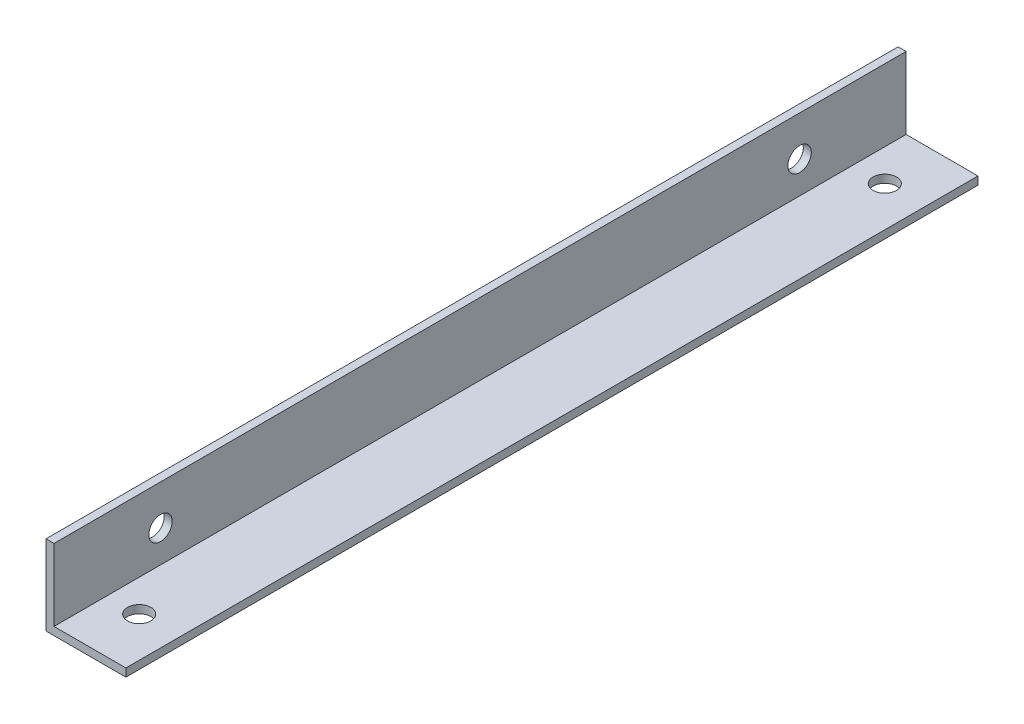
ISO-10303-21;
HEADER;
FILE_DESCRIPTION(('STEP AP214'),'2;1');
FILE_NAME('part.step','',(''),(''),'','','');
FILE_SCHEMA(('AUTOMOTIVE_DESIGN { 1 0 10303 214 1 1 1 1 }'));
ENDSEC;
DATA;
#1=APPLICATION_CONTEXT('core data for automotive mechanical design processes');
#2=APPLICATION_PROTOCOL_DEFINITION('international standard','automotive_design',2000,#1);
#3=PRODUCT_CONTEXT('',#1,'mechanical');
#4=PRODUCT('Part','Part','',(#3));
#5=PRODUCT_RELATED_PRODUCT_CATEGORY('part','',(#4));
#6=PRODUCT_DEFINITION_FORMATION('','',#4);
#7=PRODUCT_DEFINITION_CONTEXT('part definition',#1,'design');
#8=PRODUCT_DEFINITION('design','',#6,#7);
#9=PRODUCT_DEFINITION_SHAPE('','',#8);
#10=(LENGTH_UNIT() NAMED_UNIT(*) SI_UNIT(.MILLI.,.METRE.));
#11=(NAMED_UNIT(*) PLANE_ANGLE_UNIT() SI_UNIT($,.RADIAN.));
#12=(NAMED_UNIT(*) SI_UNIT($,.STERADIAN.) SOLID_ANGLE_UNIT());
#13=UNCERTAINTY_MEASURE_WITH_UNIT(LENGTH_MEASURE(1.E-05),#10,'distance_accuracy_value','');
#14=(GEOMETRIC_REPRESENTATION_CONTEXT(3) GLOBAL_UNCERTAINTY_ASSIGNED_CONTEXT((#13)) GLOBAL_UNIT_ASSIGNED_CONTEXT((#10,
#11,#12)) REPRESENTATION_CONTEXT('',''));
#15=CARTESIAN_POINT('',(0.,0.,0.));
#16=DIRECTION('',(0.,0.,1.));
#17=DIRECTION('',(1.,0.,0.));
#18=AXIS2_PLACEMENT_3D('',#15,#16,#17);
#19=CARTESIAN_POINT('',(15.,0.,160.));
#20=DIRECTION('',(0.,1.,0.));
#21=DIRECTION('',(-1.,0.,0.));
#22=AXIS2_PLACEMENT_3D('',#19,#20,#21);
#23=PLANE('',#22);
#24=CARTESIAN_POINT('',(7.5,0.,10.));
#25=DIRECTION('',(0.,-1.,0.));
#26=DIRECTION('',(1.,0.,0.));
#27=AXIS2_PLACEMENT_3D('',#24,#25,#26);
#28=CIRCLE('',#27,2.2);
#29=CARTESIAN_POINT('',(9.7,0.,10.));
#30=VERTEX_POINT('',#29);
#31=EDGE_CURVE('E137',#30,#30,#28,.T.);
#32=ORIENTED_EDGE('',*,*,#31,.F.);
#33=EDGE_LOOP('',(#32));
#34=FACE_BOUND('',#33,.T.);
#35=CARTESIAN_POINT('',(7.49999999999998,0.,150.));
#36=DIRECTION('',(0.,-1.,0.));
#37=DIRECTION('',(1.,0.,0.));
#38=AXIS2_PLACEMENT_3D('',#35,#36,#37);
#39=CIRCLE('',#38,2.2);
#40=CARTESIAN_POINT('',(9.69999999999998,0.,150.));
#41=VERTEX_POINT('',#40);
#42=EDGE_CURVE('E143',#41,#41,#39,.T.);
#43=ORIENTED_EDGE('',*,*,#42,.F.);
#44=EDGE_LOOP('',(#43));
#45=FACE_BOUND('',#44,.T.);
#46=DIRECTION('',(1.,0.,0.));
#47=VECTOR('',#46,1.);
#48=CARTESIAN_POINT('',(15.,0.,0.));
#49=LINE('',#48,#47);
#50=CARTESIAN_POINT('',(0.,0.,0.));
#51=VERTEX_POINT('',#50);
#52=CARTESIAN_POINT('',(15.,0.,0.));
#53=VERTEX_POINT('',#52);
#54=EDGE_CURVE('E119',#51,#53,#49,.T.);
#55=ORIENTED_EDGE('',*,*,#54,.T.);
#56=DIRECTION('',(0.,0.,-1.));
#57=VECTOR('',#56,1.);
#58=CARTESIAN_POINT('',(15.,0.,160.));
#59=LINE('',#58,#57);
#60=CARTESIAN_POINT('',(15.,0.,160.));
#61=VERTEX_POINT('',#60);
#62=EDGE_CURVE('E11',#61,#53,#59,.T.);
#63=ORIENTED_EDGE('',*,*,#62,.F.);
#64=DIRECTION('',(1.,0.,0.));
#65=VECTOR('',#64,1.);
#66=CARTESIAN_POINT('',(15.,0.,160.));
#67=LINE('',#66,#65);
#68=CARTESIAN_POINT('',(0.,0.,160.));
#69=VERTEX_POINT('',#68);
#70=EDGE_CURVE('E130',#69,#61,#67,.T.);
#71=ORIENTED_EDGE('',*,*,#70,.F.);
#72=DIRECTION('',(0.,0.,-1.));
#73=VECTOR('',#72,1.);
#74=CARTESIAN_POINT('',(0.,0.,160.));
#75=LINE('',#74,#73);
#76=EDGE_CURVE('E115',#69,#51,#75,.T.);
#77=ORIENTED_EDGE('',*,*,#76,.T.);
#78=EDGE_LOOP('',(#55,#63,#71,#77));
#79=FACE_BOUND('',#78,.T.);
#80=ADVANCED_FACE('F33',(#34,#45,#79),#23,.F.);
#81=CARTESIAN_POINT('',(15.,1.5,160.));
#82=DIRECTION('',(-1.,0.,0.));
#83=DIRECTION('',(0.,0.,1.));
#84=AXIS2_PLACEMENT_3D('',#81,#82,#83);
#85=PLANE('',#84);
#86=DIRECTION('',(0.,1.,0.));
#87=VECTOR('',#86,1.);
#88=CARTESIAN_POINT('',(15.,1.5,0.));
#89=LINE('',#88,#87);
#90=CARTESIAN_POINT('',(15.,1.5,0.));
#91=VERTEX_POINT('',#90);
#92=EDGE_CURVE('E122',#53,#91,#89,.T.);
#93=ORIENTED_EDGE('',*,*,#92,.T.);
#94=DIRECTION('',(0.,0.,-1.));
#95=VECTOR('',#94,1.);
#96=CARTESIAN_POINT('',(15.,1.5,160.));
#97=LINE('',#96,#95);
#98=CARTESIAN_POINT('',(15.,1.5,160.));
#99=VERTEX_POINT('',#98);
#100=EDGE_CURVE('E42',#99,#91,#97,.T.);
#101=ORIENTED_EDGE('',*,*,#100,.F.);
#102=DIRECTION('',(0.,1.,0.));
#103=VECTOR('',#102,1.);
#104=CARTESIAN_POINT('',(15.,1.5,160.));
#105=LINE('',#104,#103);
#106=EDGE_CURVE('E88',#61,#99,#105,.T.);
#107=ORIENTED_EDGE('',*,*,#106,.F.);
#108=ORIENTED_EDGE('',*,*,#62,.T.);
#109=EDGE_LOOP('',(#93,#101,#107,#108));
#110=FACE_BOUND('',#109,.T.);
#111=ADVANCED_FACE('F163',(#110),#85,.F.);
#112=CARTESIAN_POINT('',(1.5,1.5,160.));
#113=DIRECTION('',(0.,-1.,0.));
#114=DIRECTION('',(0.,0.,-1.));
#115=AXIS2_PLACEMENT_3D('',#112,#113,#114);
#116=PLANE('',#115);
#117=CARTESIAN_POINT('',(7.5,1.5,10.));
#118=DIRECTION('',(0.,-1.,0.));
#119=DIRECTION('',(0.,0.,-1.));
#120=AXIS2_PLACEMENT_3D('',#117,#118,#119);
#121=CIRCLE('',#120,2.2);
#122=CARTESIAN_POINT('',(7.5,1.5,7.8));
#123=VERTEX_POINT('',#122);
#124=EDGE_CURVE('E36',#123,#123,#121,.T.);
#125=ORIENTED_EDGE('',*,*,#124,.T.);
#126=EDGE_LOOP('',(#125));
#127=FACE_BOUND('',#126,.T.);
#128=CARTESIAN_POINT('',(7.49999999999998,1.5,150.));
#129=DIRECTION('',(0.,-1.,0.));
#130=DIRECTION('',(0.,0.,-1.));
#131=AXIS2_PLACEMENT_3D('',#128,#129,#130);
#132=CIRCLE('',#131,2.2);
#133=CARTESIAN_POINT('',(7.49999999999998,1.5,147.8));
#134=VERTEX_POINT('',#133);
#135=EDGE_CURVE('E135',#134,#134,#132,.T.);
#136=ORIENTED_EDGE('',*,*,#135,.T.);
#137=EDGE_LOOP('',(#136));
#138=FACE_BOUND('',#137,.T.);
#139=DIRECTION('',(-1.,0.,0.));
#140=VECTOR('',#139,1.);
#141=CARTESIAN_POINT('',(1.5,1.5,0.));
#142=LINE('',#141,#140);
#143=CARTESIAN_POINT('',(1.5,1.5,0.));
#144=VERTEX_POINT('',#143);
#145=EDGE_CURVE('E125',#91,#144,#142,.T.);
#146=ORIENTED_EDGE('',*,*,#145,.T.);
#147=DIRECTION('',(0.,0.,-1.));
#148=VECTOR('',#147,1.);
#149=CARTESIAN_POINT('',(1.5,1.5,160.));
#150=LINE('',#149,#148);
#151=CARTESIAN_POINT('',(1.5,1.5,160.));
#152=VERTEX_POINT('',#151);
#153=EDGE_CURVE('E110',#152,#144,#150,.T.);
#154=ORIENTED_EDGE('',*,*,#153,.F.);
#155=DIRECTION('',(-1.,0.,0.));
#156=VECTOR('',#155,1.);
#157=CARTESIAN_POINT('',(1.5,1.5,160.));
#158=LINE('',#157,#156);
#159=EDGE_CURVE('E101',#99,#152,#158,.T.);
#160=ORIENTED_EDGE('',*,*,#159,.F.);
#161=ORIENTED_EDGE('',*,*,#100,.T.);
#162=EDGE_LOOP('',(#146,#154,#160,#161));
#163=FACE_BOUND('',#162,.T.);
#164=ADVANCED_FACE('F166',(#127,#138,#163),#116,.F.);
#165=CARTESIAN_POINT('',(1.5,15.,160.));
#166=DIRECTION('',(-1.,0.,0.));
#167=DIRECTION('',(0.,-1.,0.));
#168=AXIS2_PLACEMENT_3D('',#165,#166,#167);
#169=PLANE('',#168);
#170=CARTESIAN_POINT('',(1.5,7.49999999999998,20.));
#171=DIRECTION('',(-1.,0.,0.));
#172=DIRECTION('',(0.,-1.,0.));
#173=AXIS2_PLACEMENT_3D('',#170,#171,#172);
#174=CIRCLE('',#173,2.2);
#175=CARTESIAN_POINT('',(1.5,5.29999999999998,20.));
#176=VERTEX_POINT('',#175);
#177=EDGE_CURVE('E123',#176,#176,#174,.T.);
#178=ORIENTED_EDGE('',*,*,#177,.T.);
#179=EDGE_LOOP('',(#178));
#180=FACE_BOUND('',#179,.T.);
#181=CARTESIAN_POINT('',(1.5,7.5,140.));
#182=DIRECTION('',(-1.,0.,0.));
#183=DIRECTION('',(0.,-1.,0.));
#184=AXIS2_PLACEMENT_3D('',#181,#182,#183);
#185=CIRCLE('',#184,2.20000000000001);
#186=CARTESIAN_POINT('',(1.5,5.29999999999998,140.));
#187=VERTEX_POINT('',#186);
#188=EDGE_CURVE('E153',#187,#187,#185,.T.);
#189=ORIENTED_EDGE('',*,*,#188,.T.);
#190=EDGE_LOOP('',(#189));
#191=FACE_BOUND('',#190,.T.);
#192=DIRECTION('',(0.,1.,0.));
#193=VECTOR('',#192,1.);
#194=CARTESIAN_POINT('',(1.5,15.,0.));
#195=LINE('',#194,#193);
#196=CARTESIAN_POINT('',(1.5,15.,0.));
#197=VERTEX_POINT('',#196);
#198=EDGE_CURVE('E109',#144,#197,#195,.T.);
#199=ORIENTED_EDGE('',*,*,#198,.T.);
#200=DIRECTION('',(0.,0.,-1.));
#201=VECTOR('',#200,1.);
#202=CARTESIAN_POINT('',(1.5,15.,160.));
#203=LINE('',#202,#201);
#204=CARTESIAN_POINT('',(1.5,15.,160.));
#205=VERTEX_POINT('',#204);
#206=EDGE_CURVE('E106',#205,#197,#203,.T.);
#207=ORIENTED_EDGE('',*,*,#206,.F.);
#208=DIRECTION('',(0.,1.,0.));
#209=VECTOR('',#208,1.);
#210=CARTESIAN_POINT('',(1.5,15.,160.));
#211=LINE('',#210,#209);
#212=EDGE_CURVE('E95',#152,#205,#211,.T.);
#213=ORIENTED_EDGE('',*,*,#212,.F.);
#214=ORIENTED_EDGE('',*,*,#153,.T.);
#215=EDGE_LOOP('',(#199,#207,#213,#214));
#216=FACE_BOUND('',#215,.T.);
#217=ADVANCED_FACE('F107',(#180,#191,#216),#169,.F.);
#218=CARTESIAN_POINT('',(0.,15.,160.));
#219=DIRECTION('',(0.,-1.,0.));
#220=DIRECTION('',(0.,0.,-1.));
#221=AXIS2_PLACEMENT_3D('',#218,#219,#220);
#222=PLANE('',#221);
#223=DIRECTION('',(-1.,0.,0.));
#224=VECTOR('',#223,1.);
#225=CARTESIAN_POINT('',(0.,15.,0.));
#226=LINE('',#225,#224);
#227=CARTESIAN_POINT('',(0.,15.,0.));
#228=VERTEX_POINT('',#227);
#229=EDGE_CURVE('E74',#197,#228,#226,.T.);
#230=ORIENTED_EDGE('',*,*,#229,.T.);
#231=DIRECTION('',(0.,0.,-1.));
#232=VECTOR('',#231,1.);
#233=CARTESIAN_POINT('',(0.,15.,160.));
#234=LINE('',#233,#232);
#235=CARTESIAN_POINT('',(0.,15.,160.));
#236=VERTEX_POINT('',#235);
#237=EDGE_CURVE('E111',#236,#228,#234,.T.);
#238=ORIENTED_EDGE('',*,*,#237,.F.);
#239=DIRECTION('',(-1.,0.,0.));
#240=VECTOR('',#239,1.);
#241=CARTESIAN_POINT('',(0.,15.,160.));
#242=LINE('',#241,#240);
#243=EDGE_CURVE('E99',#205,#236,#242,.T.);
#244=ORIENTED_EDGE('',*,*,#243,.F.);
#245=ORIENTED_EDGE('',*,*,#206,.T.);
#246=EDGE_LOOP('',(#230,#238,#244,#245));
#247=FACE_BOUND('',#246,.T.);
#248=ADVANCED_FACE('F113',(#247),#222,.F.);
#249=CARTESIAN_POINT('',(0.,0.,160.));
#250=DIRECTION('',(1.,0.,0.));
#251=DIRECTION('',(0.,0.,-1.));
#252=AXIS2_PLACEMENT_3D('',#249,#250,#251);
#253=PLANE('',#252);
#254=CARTESIAN_POINT('',(0.,7.49999999999998,20.));
#255=DIRECTION('',(-1.,0.,0.));
#256=DIRECTION('',(0.,0.,1.));
#257=AXIS2_PLACEMENT_3D('',#254,#255,#256);
#258=CIRCLE('',#257,2.2);
#259=CARTESIAN_POINT('',(0.,7.49999999999998,22.2));
#260=VERTEX_POINT('',#259);
#261=EDGE_CURVE('E150',#260,#260,#258,.T.);
#262=ORIENTED_EDGE('',*,*,#261,.F.);
#263=EDGE_LOOP('',(#262));
#264=FACE_BOUND('',#263,.T.);
#265=CARTESIAN_POINT('',(0.,7.5,140.));
#266=DIRECTION('',(-1.,0.,0.));
#267=DIRECTION('',(0.,0.,1.));
#268=AXIS2_PLACEMENT_3D('',#265,#266,#267);
#269=CIRCLE('',#268,2.20000000000001);
#270=CARTESIAN_POINT('',(0.,7.5,142.2));
#271=VERTEX_POINT('',#270);
#272=EDGE_CURVE('E141',#271,#271,#269,.T.);
#273=ORIENTED_EDGE('',*,*,#272,.F.);
#274=EDGE_LOOP('',(#273));
#275=FACE_BOUND('',#274,.T.);
#276=DIRECTION('',(0.,-1.,0.));
#277=VECTOR('',#276,1.);
#278=CARTESIAN_POINT('',(0.,0.,0.));
#279=LINE('',#278,#277);
#280=EDGE_CURVE('E80',#228,#51,#279,.T.);
#281=ORIENTED_EDGE('',*,*,#280,.T.);
#282=ORIENTED_EDGE('',*,*,#76,.F.);
#283=DIRECTION('',(0.,-1.,0.));
#284=VECTOR('',#283,1.);
#285=CARTESIAN_POINT('',(0.,0.,160.));
#286=LINE('',#285,#284);
#287=EDGE_CURVE('E51',#236,#69,#286,.T.);
#288=ORIENTED_EDGE('',*,*,#287,.F.);
#289=ORIENTED_EDGE('',*,*,#237,.T.);
#290=EDGE_LOOP('',(#281,#282,#288,#289));
#291=FACE_BOUND('',#290,.T.);
#292=ADVANCED_FACE('F171',(#264,#275,#291),#253,.F.);
#293=CARTESIAN_POINT('',(0.,0.,160.));
#294=DIRECTION('',(0.,0.,-1.));
#295=DIRECTION('',(-1.,0.,0.));
#296=AXIS2_PLACEMENT_3D('',#293,#294,#295);
#297=PLANE('',#296);
#298=ORIENTED_EDGE('',*,*,#70,.T.);
#299=ORIENTED_EDGE('',*,*,#106,.T.);
#300=ORIENTED_EDGE('',*,*,#159,.T.);
#301=ORIENTED_EDGE('',*,*,#212,.T.);
#302=ORIENTED_EDGE('',*,*,#243,.T.);
#303=ORIENTED_EDGE('',*,*,#287,.T.);
#304=EDGE_LOOP('',(#298,#299,#300,#301,#302,#303));
#305=FACE_BOUND('',#304,.T.);
#306=ADVANCED_FACE('F97',(#305),#297,.F.);
#307=CARTESIAN_POINT('',(0.,0.,0.));
#308=DIRECTION('',(0.,0.,-1.));
#309=DIRECTION('',(-1.,0.,0.));
#310=AXIS2_PLACEMENT_3D('',#307,#308,#309);
#311=PLANE('',#310);
#312=ORIENTED_EDGE('',*,*,#54,.F.);
#313=ORIENTED_EDGE('',*,*,#280,.F.);
#314=ORIENTED_EDGE('',*,*,#229,.F.);
#315=ORIENTED_EDGE('',*,*,#198,.F.);
#316=ORIENTED_EDGE('',*,*,#145,.F.);
#317=ORIENTED_EDGE('',*,*,#92,.F.);
#318=EDGE_LOOP('',(#312,#313,#314,#315,#316,#317));
#319=FACE_BOUND('',#318,.T.);
#320=ADVANCED_FACE('F169',(#319),#311,.T.);
#321=CARTESIAN_POINT('',(15.,7.5,140.));
#322=DIRECTION('',(-1.,0.,0.));
#323=DIRECTION('',(0.,0.,1.));
#324=AXIS2_PLACEMENT_3D('',#321,#322,#323);
#325=CYLINDRICAL_SURFACE('',#324,2.20000000000001);
#326=ORIENTED_EDGE('',*,*,#272,.T.);
#327=EDGE_LOOP('',(#326));
#328=FACE_BOUND('',#327,.T.);
#329=ORIENTED_EDGE('',*,*,#188,.F.);
#330=EDGE_LOOP('',(#329));
#331=FACE_BOUND('',#330,.T.);
#332=ADVANCED_FACE('F203',(#328,#331),#325,.F.);
#333=CARTESIAN_POINT('',(15.,7.49999999999998,20.));
#334=DIRECTION('',(-1.,0.,0.));
#335=DIRECTION('',(0.,0.,1.));
#336=AXIS2_PLACEMENT_3D('',#333,#334,#335);
#337=CYLINDRICAL_SURFACE('',#336,2.2);
#338=ORIENTED_EDGE('',*,*,#261,.T.);
#339=EDGE_LOOP('',(#338));
#340=FACE_BOUND('',#339,.T.);
#341=ORIENTED_EDGE('',*,*,#177,.F.);
#342=EDGE_LOOP('',(#341));
#343=FACE_BOUND('',#342,.T.);
#344=ADVANCED_FACE('F196',(#340,#343),#337,.F.);
#345=CARTESIAN_POINT('',(7.49999999999998,160.,150.));
#346=DIRECTION('',(0.,-1.,0.));
#347=DIRECTION('',(1.,0.,0.));
#348=AXIS2_PLACEMENT_3D('',#345,#346,#347);
#349=CYLINDRICAL_SURFACE('',#348,2.2);
#350=ORIENTED_EDGE('',*,*,#42,.T.);
#351=EDGE_LOOP('',(#350));
#352=FACE_BOUND('',#351,.T.);
#353=ORIENTED_EDGE('',*,*,#135,.F.);
#354=EDGE_LOOP('',(#353));
#355=FACE_BOUND('',#354,.T.);
#356=ADVANCED_FACE('F192',(#352,#355),#349,.F.);
#357=CARTESIAN_POINT('',(7.5,160.,10.));
#358=DIRECTION('',(0.,-1.,0.));
#359=DIRECTION('',(1.,0.,0.));
#360=AXIS2_PLACEMENT_3D('',#357,#358,#359);
#361=CYLINDRICAL_SURFACE('',#360,2.2);
#362=ORIENTED_EDGE('',*,*,#31,.T.);
#363=EDGE_LOOP('',(#362));
#364=FACE_BOUND('',#363,.T.);
#365=ORIENTED_EDGE('',*,*,#124,.F.);
#366=EDGE_LOOP('',(#365));
#367=FACE_BOUND('',#366,.T.);
#368=ADVANCED_FACE('F195',(#364,#367),#361,.F.);
#369=CLOSED_SHELL('',(#80,#111,#164,#217,#248,#292,#306,#320,#332,#344,#356,#368));
#370=MANIFOLD_SOLID_BREP('B2',#369);
#371=ADVANCED_BREP_SHAPE_REPRESENTATION('',(#18,#370),#14);
#372=SHAPE_DEFINITION_REPRESENTATION(#9,#371);
ENDSEC;
END-ISO-10303-21;
